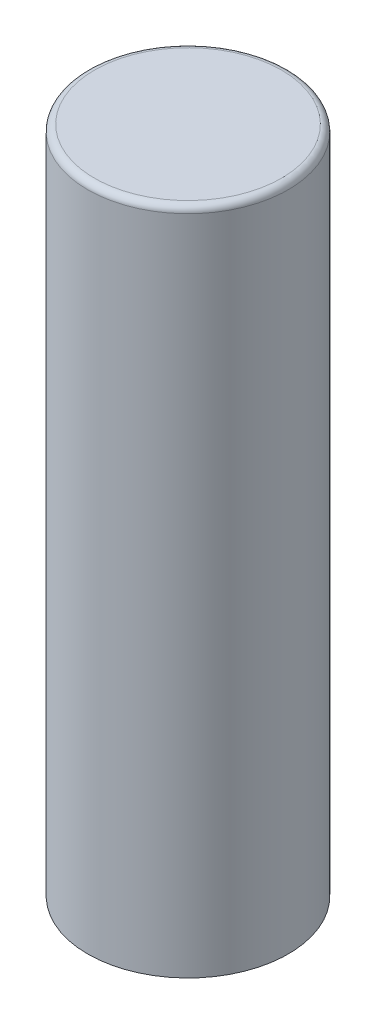
ISO-10303-21;
HEADER;
FILE_DESCRIPTION(('STEP AP214'),'2;1');
FILE_NAME('part.step','',(''),(''),'','','');
FILE_SCHEMA(('AUTOMOTIVE_DESIGN { 1 0 10303 214 1 1 1 1 }'));
ENDSEC;
DATA;
#1=APPLICATION_CONTEXT('core data for automotive mechanical design processes');
#2=APPLICATION_PROTOCOL_DEFINITION('international standard','automotive_design',2000,#1);
#3=PRODUCT_CONTEXT('',#1,'mechanical');
#4=PRODUCT('Part','Part','',(#3));
#5=PRODUCT_RELATED_PRODUCT_CATEGORY('part','',(#4));
#6=PRODUCT_DEFINITION_FORMATION('','',#4);
#7=PRODUCT_DEFINITION_CONTEXT('part definition',#1,'design');
#8=PRODUCT_DEFINITION('design','',#6,#7);
#9=PRODUCT_DEFINITION_SHAPE('','',#8);
#10=(LENGTH_UNIT() NAMED_UNIT(*) SI_UNIT(.MILLI.,.METRE.));
#11=(NAMED_UNIT(*) PLANE_ANGLE_UNIT() SI_UNIT($,.RADIAN.));
#12=(NAMED_UNIT(*) SI_UNIT($,.STERADIAN.) SOLID_ANGLE_UNIT());
#13=UNCERTAINTY_MEASURE_WITH_UNIT(LENGTH_MEASURE(1.E-05),#10,'distance_accuracy_value','');
#14=(GEOMETRIC_REPRESENTATION_CONTEXT(3) GLOBAL_UNCERTAINTY_ASSIGNED_CONTEXT((#13)) GLOBAL_UNIT_ASSIGNED_CONTEXT((#10,
#11,#12)) REPRESENTATION_CONTEXT('',''));
#15=CARTESIAN_POINT('',(0.,0.,0.));
#16=DIRECTION('',(0.,0.,1.));
#17=DIRECTION('',(1.,0.,0.));
#18=AXIS2_PLACEMENT_3D('',#15,#16,#17);
#19=CARTESIAN_POINT('',(0.,350.,0.));
#20=DIRECTION('',(0.,-1.,0.));
#21=DIRECTION('',(0.,0.,-1.));
#22=AXIS2_PLACEMENT_3D('',#19,#20,#21);
#23=PLANE('',#22);
#24=CARTESIAN_POINT('',(0.,350.,0.));
#25=DIRECTION('',(0.,-1.,0.));
#26=DIRECTION('',(0.,0.,-1.));
#27=AXIS2_PLACEMENT_3D('',#24,#25,#26);
#28=CIRCLE('',#27,49.);
#29=CARTESIAN_POINT('',(0.,350.,-49.));
#30=VERTEX_POINT('',#29);
#31=EDGE_CURVE('E10',#30,#30,#28,.T.);
#32=ORIENTED_EDGE('',*,*,#31,.F.);
#33=EDGE_LOOP('',(#32));
#34=FACE_BOUND('',#33,.T.);
#35=ADVANCED_FACE('F34',(#34),#23,.F.);
#36=CARTESIAN_POINT('',(0.,346.5,0.));
#37=DIRECTION('',(0.,-1.,0.));
#38=DIRECTION('',(0.,0.,-1.));
#39=AXIS2_PLACEMENT_3D('',#36,#37,#38);
#40=TOROIDAL_SURFACE('',#39,49.,3.50000000000001);
#41=CARTESIAN_POINT('',(0.,346.5,0.));
#42=DIRECTION('',(0.,-1.,0.));
#43=DIRECTION('',(0.,0.,-1.));
#44=AXIS2_PLACEMENT_3D('',#41,#42,#43);
#45=CIRCLE('',#44,52.5);
#46=CARTESIAN_POINT('',(0.,346.5,-52.5));
#47=VERTEX_POINT('',#46);
#48=EDGE_CURVE('E40',#47,#47,#45,.T.);
#49=ORIENTED_EDGE('',*,*,#48,.F.);
#50=EDGE_LOOP('',(#49));
#51=FACE_BOUND('',#50,.T.);
#52=ORIENTED_EDGE('',*,*,#31,.T.);
#53=EDGE_LOOP('',(#52));
#54=FACE_BOUND('',#53,.T.);
#55=ADVANCED_FACE('F73',(#51,#54),#40,.T.);
#56=CARTESIAN_POINT('',(0.,0.,0.));
#57=DIRECTION('',(0.,-1.,0.));
#58=DIRECTION('',(0.,0.,-1.));
#59=AXIS2_PLACEMENT_3D('',#56,#57,#58);
#60=CYLINDRICAL_SURFACE('',#59,52.5);
#61=CARTESIAN_POINT('',(0.,0.,0.));
#62=DIRECTION('',(0.,-1.,0.));
#63=DIRECTION('',(0.,0.,-1.));
#64=AXIS2_PLACEMENT_3D('',#61,#62,#63);
#65=CIRCLE('',#64,52.5);
#66=CARTESIAN_POINT('',(0.,0.,-52.5));
#67=VERTEX_POINT('',#66);
#68=EDGE_CURVE('E44',#67,#67,#65,.T.);
#69=ORIENTED_EDGE('',*,*,#68,.F.);
#70=EDGE_LOOP('',(#69));
#71=FACE_BOUND('',#70,.T.);
#72=ORIENTED_EDGE('',*,*,#48,.T.);
#73=EDGE_LOOP('',(#72));
#74=FACE_BOUND('',#73,.T.);
#75=ADVANCED_FACE('F68',(#71,#74),#60,.T.);
#76=CARTESIAN_POINT('',(-52.5,0.,0.));
#77=DIRECTION('',(0.,1.,0.));
#78=DIRECTION('',(0.,0.,1.));
#79=AXIS2_PLACEMENT_3D('',#76,#77,#78);
#80=PLANE('',#79);
#81=CARTESIAN_POINT('',(0.,0.,0.));
#82=DIRECTION('',(0.,-1.,0.));
#83=DIRECTION('',(0.,0.,-1.));
#84=AXIS2_PLACEMENT_3D('',#81,#82,#83);
#85=CIRCLE('',#84,45.5);
#86=CARTESIAN_POINT('',(0.,0.,-45.5));
#87=VERTEX_POINT('',#86);
#88=EDGE_CURVE('E48',#87,#87,#85,.T.);
#89=ORIENTED_EDGE('',*,*,#88,.F.);
#90=EDGE_LOOP('',(#89));
#91=FACE_BOUND('',#90,.T.);
#92=ORIENTED_EDGE('',*,*,#68,.T.);
#93=EDGE_LOOP('',(#92));
#94=FACE_BOUND('',#93,.T.);
#95=ADVANCED_FACE('F62',(#91,#94),#80,.F.);
#96=CARTESIAN_POINT('',(0.,0.,0.));
#97=DIRECTION('',(0.,-1.,0.));
#98=DIRECTION('',(0.,0.,-1.));
#99=AXIS2_PLACEMENT_3D('',#96,#97,#98);
#100=CYLINDRICAL_SURFACE('',#99,45.5);
#101=CARTESIAN_POINT('',(0.,343.,0.));
#102=DIRECTION('',(0.,-1.,0.));
#103=DIRECTION('',(0.,0.,-1.));
#104=AXIS2_PLACEMENT_3D('',#101,#102,#103);
#105=CIRCLE('',#104,45.5);
#106=CARTESIAN_POINT('',(0.,343.,-45.5));
#107=VERTEX_POINT('',#106);
#108=EDGE_CURVE('E53',#107,#107,#105,.T.);
#109=ORIENTED_EDGE('',*,*,#108,.F.);
#110=EDGE_LOOP('',(#109));
#111=FACE_BOUND('',#110,.T.);
#112=ORIENTED_EDGE('',*,*,#88,.T.);
#113=EDGE_LOOP('',(#112));
#114=FACE_BOUND('',#113,.T.);
#115=ADVANCED_FACE('F59',(#111,#114),#100,.F.);
#116=CARTESIAN_POINT('',(-45.5,343.,0.));
#117=DIRECTION('',(0.,1.,0.));
#118=DIRECTION('',(0.,0.,1.));
#119=AXIS2_PLACEMENT_3D('',#116,#117,#118);
#120=PLANE('',#119);
#121=ORIENTED_EDGE('',*,*,#108,.T.);
#122=EDGE_LOOP('',(#121));
#123=FACE_BOUND('',#122,.T.);
#124=ADVANCED_FACE('F57',(#123),#120,.F.);
#125=CLOSED_SHELL('',(#35,#55,#75,#95,#115,#124));
#126=MANIFOLD_SOLID_BREP('B2',#125);
#127=ADVANCED_BREP_SHAPE_REPRESENTATION('',(#18,#126),#14);
#128=SHAPE_DEFINITION_REPRESENTATION(#9,#127);
ENDSEC;
END-ISO-10303-21;
